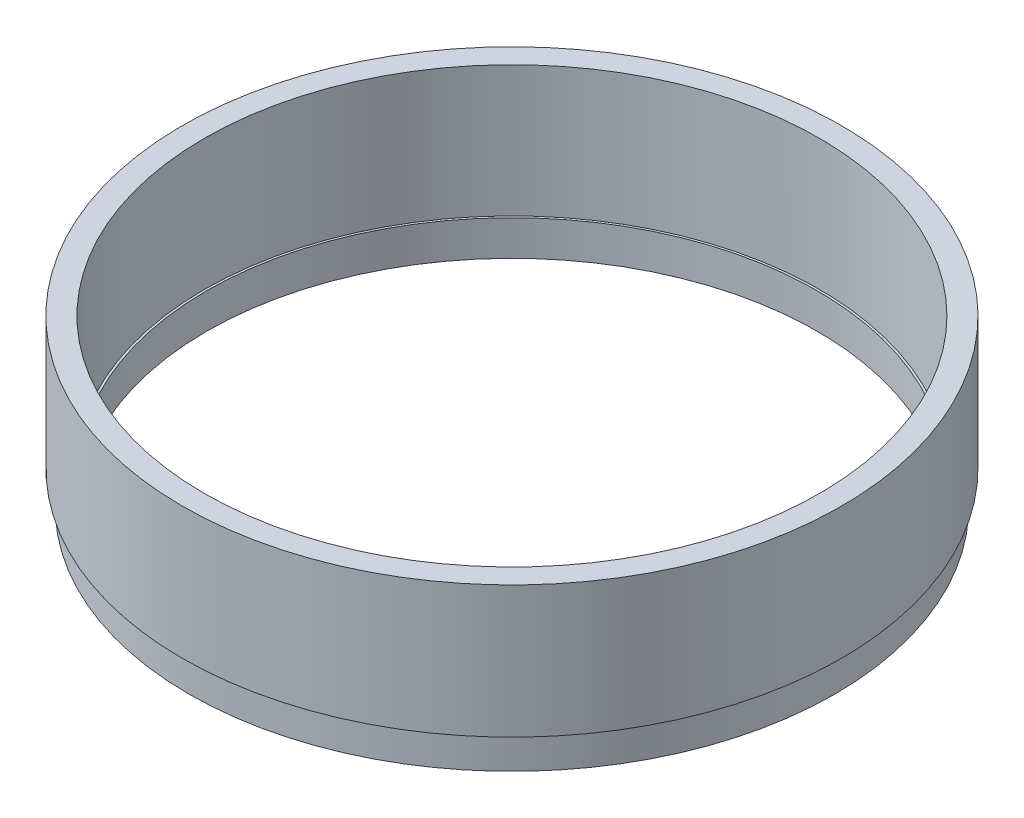
ISO-10303-21;
HEADER;
FILE_DESCRIPTION(('STEP AP214'),'2;1');
FILE_NAME('part.step','',(''),(''),'','','');
FILE_SCHEMA(('AUTOMOTIVE_DESIGN { 1 0 10303 214 1 1 1 1 }'));
ENDSEC;
DATA;
#1=APPLICATION_CONTEXT('core data for automotive mechanical design processes');
#2=APPLICATION_PROTOCOL_DEFINITION('international standard','automotive_design',2000,#1);
#3=PRODUCT_CONTEXT('',#1,'mechanical');
#4=PRODUCT('Part','Part','',(#3));
#5=PRODUCT_RELATED_PRODUCT_CATEGORY('part','',(#4));
#6=PRODUCT_DEFINITION_FORMATION('','',#4);
#7=PRODUCT_DEFINITION_CONTEXT('part definition',#1,'design');
#8=PRODUCT_DEFINITION('design','',#6,#7);
#9=PRODUCT_DEFINITION_SHAPE('','',#8);
#10=(LENGTH_UNIT() NAMED_UNIT(*) SI_UNIT(.MILLI.,.METRE.));
#11=(NAMED_UNIT(*) PLANE_ANGLE_UNIT() SI_UNIT($,.RADIAN.));
#12=(NAMED_UNIT(*) SI_UNIT($,.STERADIAN.) SOLID_ANGLE_UNIT());
#13=UNCERTAINTY_MEASURE_WITH_UNIT(LENGTH_MEASURE(1.E-05),#10,'distance_accuracy_value','');
#14=(GEOMETRIC_REPRESENTATION_CONTEXT(3) GLOBAL_UNCERTAINTY_ASSIGNED_CONTEXT((#13)) GLOBAL_UNIT_ASSIGNED_CONTEXT((#10,
#11,#12)) REPRESENTATION_CONTEXT('',''));
#15=CARTESIAN_POINT('',(0.,0.,0.));
#16=DIRECTION('',(0.,0.,1.));
#17=DIRECTION('',(1.,0.,0.));
#18=AXIS2_PLACEMENT_3D('',#15,#16,#17);
#19=CARTESIAN_POINT('',(13.5413484331681,15.,-6.62676831259949));
#20=DIRECTION('',(0.,-1.,0.));
#21=DIRECTION('',(0.,0.,-1.));
#22=AXIS2_PLACEMENT_3D('',#19,#20,#21);
#23=CYLINDRICAL_SURFACE('',#22,35.);
#24=CARTESIAN_POINT('',(13.5413484331681,15.,-6.62676831259949));
#25=DIRECTION('',(0.,1.,0.));
#26=DIRECTION('',(0.,0.,1.));
#27=AXIS2_PLACEMENT_3D('',#24,#25,#26);
#28=CIRCLE('',#27,35.);
#29=CARTESIAN_POINT('',(13.5413484331681,15.,28.3732316874005));
#30=VERTEX_POINT('',#29);
#31=EDGE_CURVE('E91',#30,#30,#28,.T.);
#32=ORIENTED_EDGE('',*,*,#31,.T.);
#33=EDGE_LOOP('',(#32));
#34=FACE_BOUND('',#33,.T.);
#35=CARTESIAN_POINT('',(13.5413484331681,0.0999999999999994,-6.62676831259949));
#36=DIRECTION('',(0.,-1.,0.));
#37=DIRECTION('',(0.,0.,-1.));
#38=AXIS2_PLACEMENT_3D('',#35,#36,#37);
#39=CIRCLE('',#38,35.);
#40=CARTESIAN_POINT('',(-21.4586515668319,0.0999999999999982,-6.62676831259949));
#41=VERTEX_POINT('',#40);
#42=EDGE_CURVE('E49',#41,#41,#39,.T.);
#43=ORIENTED_EDGE('',*,*,#42,.T.);
#44=EDGE_LOOP('',(#43));
#45=FACE_BOUND('',#44,.T.);
#46=ADVANCED_FACE('F41',(#34,#45),#23,.F.);
#47=CARTESIAN_POINT('',(13.5413484331681,15.,-6.62676831259949));
#48=DIRECTION('',(0.,1.,0.));
#49=DIRECTION('',(0.,0.,1.));
#50=AXIS2_PLACEMENT_3D('',#47,#48,#49);
#51=PLANE('',#50);
#52=CARTESIAN_POINT('',(13.5413484331681,15.,-6.62676831259949));
#53=DIRECTION('',(0.,1.,0.));
#54=DIRECTION('',(0.,0.,1.));
#55=AXIS2_PLACEMENT_3D('',#52,#53,#54);
#56=CIRCLE('',#55,37.5);
#57=CARTESIAN_POINT('',(13.5413484331681,15.,30.8732316874005));
#58=VERTEX_POINT('',#57);
#59=EDGE_CURVE('E96',#58,#58,#56,.T.);
#60=ORIENTED_EDGE('',*,*,#59,.T.);
#61=EDGE_LOOP('',(#60));
#62=FACE_BOUND('',#61,.T.);
#63=ORIENTED_EDGE('',*,*,#31,.F.);
#64=EDGE_LOOP('',(#63));
#65=FACE_BOUND('',#64,.T.);
#66=ADVANCED_FACE('F115',(#62,#65),#51,.T.);
#67=CARTESIAN_POINT('',(13.5413484331681,0.,-6.62676831259949));
#68=DIRECTION('',(0.,1.,0.));
#69=DIRECTION('',(0.,0.,1.));
#70=AXIS2_PLACEMENT_3D('',#67,#68,#69);
#71=PLANE('',#70);
#72=CARTESIAN_POINT('',(13.5413484331681,0.,-6.62676831259949));
#73=DIRECTION('',(0.,1.,0.));
#74=DIRECTION('',(0.,0.,1.));
#75=AXIS2_PLACEMENT_3D('',#72,#73,#74);
#76=CIRCLE('',#75,36.75);
#77=CARTESIAN_POINT('',(-23.2086515668319,0.,-6.62676831259949));
#78=VERTEX_POINT('',#77);
#79=EDGE_CURVE('E11',#78,#78,#76,.F.);
#80=ORIENTED_EDGE('',*,*,#79,.F.);
#81=EDGE_LOOP('',(#80));
#82=FACE_BOUND('',#81,.T.);
#83=CARTESIAN_POINT('',(13.5413484331681,0.,-6.62676831259949));
#84=DIRECTION('',(0.,1.,0.));
#85=DIRECTION('',(0.,0.,1.));
#86=AXIS2_PLACEMENT_3D('',#83,#84,#85);
#87=CIRCLE('',#86,37.5);
#88=CARTESIAN_POINT('',(13.5413484331681,0.,30.8732316874005));
#89=VERTEX_POINT('',#88);
#90=EDGE_CURVE('E95',#89,#89,#87,.T.);
#91=ORIENTED_EDGE('',*,*,#90,.F.);
#92=EDGE_LOOP('',(#91));
#93=FACE_BOUND('',#92,.T.);
#94=ADVANCED_FACE('F123',(#82,#93),#71,.F.);
#95=CARTESIAN_POINT('',(13.5413484331681,15.,-6.62676831259949));
#96=DIRECTION('',(0.,-1.,0.));
#97=DIRECTION('',(0.,0.,-1.));
#98=AXIS2_PLACEMENT_3D('',#95,#96,#97);
#99=CYLINDRICAL_SURFACE('',#98,37.5);
#100=ORIENTED_EDGE('',*,*,#59,.F.);
#101=EDGE_LOOP('',(#100));
#102=FACE_BOUND('',#101,.T.);
#103=ORIENTED_EDGE('',*,*,#90,.T.);
#104=EDGE_LOOP('',(#103));
#105=FACE_BOUND('',#104,.T.);
#106=ADVANCED_FACE('F43',(#102,#105),#99,.T.);
#107=CARTESIAN_POINT('',(13.5413484331681,-1.,-6.62676831259949));
#108=DIRECTION('',(0.,-1.,0.));
#109=DIRECTION('',(0.,0.,-1.));
#110=AXIS2_PLACEMENT_3D('',#107,#108,#109);
#111=CYLINDRICAL_SURFACE('',#110,36.75);
#112=DIRECTION('',(0.,-1.,0.));
#113=VECTOR('',#112,1.);
#114=CARTESIAN_POINT('',(-23.2086515668319,0.0999999999999999,-6.62676831259949));
#115=LINE('',#114,#113);
#116=CARTESIAN_POINT('',(-23.2086515668319,-3.9,-6.62676831259949));
#117=VERTEX_POINT('',#116);
#118=EDGE_CURVE('E71',#78,#117,#115,.T.);
#119=ORIENTED_EDGE('',*,*,#118,.F.);
#120=ORIENTED_EDGE('',*,*,#79,.T.);
#121=ORIENTED_EDGE('',*,*,#118,.T.);
#122=CARTESIAN_POINT('',(13.5413484331681,-3.9,-6.62676831259949));
#123=DIRECTION('',(0.,-1.,0.));
#124=DIRECTION('',(-1.,0.,0.));
#125=AXIS2_PLACEMENT_3D('',#122,#123,#124);
#126=CIRCLE('',#125,36.75);
#127=EDGE_CURVE('E74',#117,#117,#126,.T.);
#128=ORIENTED_EDGE('',*,*,#127,.F.);
#129=EDGE_LOOP('',(#119,#120,#121,#128));
#130=FACE_BOUND('',#129,.T.);
#131=ADVANCED_FACE('F73',(#130),#111,.T.);
#132=CARTESIAN_POINT('',(-23.2086515668319,0.1,-6.62676831259949));
#133=DIRECTION('',(0.,-1.,0.));
#134=DIRECTION('',(0.,0.,-1.));
#135=AXIS2_PLACEMENT_3D('',#132,#133,#134);
#136=PLANE('',#135);
#137=ORIENTED_EDGE('',*,*,#42,.F.);
#138=EDGE_LOOP('',(#137));
#139=FACE_BOUND('',#138,.T.);
#140=CARTESIAN_POINT('',(13.5413484331681,0.1,-6.62676831259949));
#141=DIRECTION('',(0.,-1.,0.));
#142=DIRECTION('',(-1.,0.,0.));
#143=AXIS2_PLACEMENT_3D('',#140,#141,#142);
#144=CIRCLE('',#143,34.75);
#145=CARTESIAN_POINT('',(-21.2086515668319,0.1,-6.62676831259949));
#146=VERTEX_POINT('',#145);
#147=EDGE_CURVE('E84',#146,#146,#144,.T.);
#148=ORIENTED_EDGE('',*,*,#147,.T.);
#149=EDGE_LOOP('',(#148));
#150=FACE_BOUND('',#149,.T.);
#151=ADVANCED_FACE('F102',(#139,#150),#136,.F.);
#152=CARTESIAN_POINT('',(-23.2086515668319,-3.9,-6.62676831259949));
#153=DIRECTION('',(0.,1.,0.));
#154=DIRECTION('',(0.,0.,1.));
#155=AXIS2_PLACEMENT_3D('',#152,#153,#154);
#156=PLANE('',#155);
#157=ORIENTED_EDGE('',*,*,#127,.T.);
#158=EDGE_LOOP('',(#157));
#159=FACE_BOUND('',#158,.T.);
#160=CARTESIAN_POINT('',(13.5413484331681,-3.9,-6.62676831259949));
#161=DIRECTION('',(0.,-1.,0.));
#162=DIRECTION('',(-1.,0.,0.));
#163=AXIS2_PLACEMENT_3D('',#160,#161,#162);
#164=CIRCLE('',#163,34.75);
#165=CARTESIAN_POINT('',(-21.2086515668319,-3.9,-6.62676831259949));
#166=VERTEX_POINT('',#165);
#167=EDGE_CURVE('E82',#166,#166,#164,.T.);
#168=ORIENTED_EDGE('',*,*,#167,.F.);
#169=EDGE_LOOP('',(#168));
#170=FACE_BOUND('',#169,.T.);
#171=ADVANCED_FACE('F79',(#159,#170),#156,.F.);
#172=CARTESIAN_POINT('',(13.5413484331681,-1.,-6.62676831259949));
#173=DIRECTION('',(0.,-1.,0.));
#174=DIRECTION('',(0.,0.,-1.));
#175=AXIS2_PLACEMENT_3D('',#172,#173,#174);
#176=CYLINDRICAL_SURFACE('',#175,34.75);
#177=DIRECTION('',(0.,1.,0.));
#178=VECTOR('',#177,1.);
#179=CARTESIAN_POINT('',(-21.2086515668319,0.1,-6.62676831259949));
#180=LINE('',#179,#178);
#181=EDGE_CURVE('E86',#166,#146,#180,.T.);
#182=ORIENTED_EDGE('',*,*,#181,.T.);
#183=ORIENTED_EDGE('',*,*,#147,.F.);
#184=ORIENTED_EDGE('',*,*,#181,.F.);
#185=ORIENTED_EDGE('',*,*,#167,.T.);
#186=EDGE_LOOP('',(#182,#183,#184,#185));
#187=FACE_BOUND('',#186,.T.);
#188=ADVANCED_FACE('F106',(#187),#176,.F.);
#189=CLOSED_SHELL('',(#46,#66,#94,#106,#131,#151,#171,#188));
#190=MANIFOLD_SOLID_BREP('B2',#189);
#191=ADVANCED_BREP_SHAPE_REPRESENTATION('',(#18,#190),#14);
#192=SHAPE_DEFINITION_REPRESENTATION(#9,#191);
ENDSEC;
END-ISO-10303-21;
